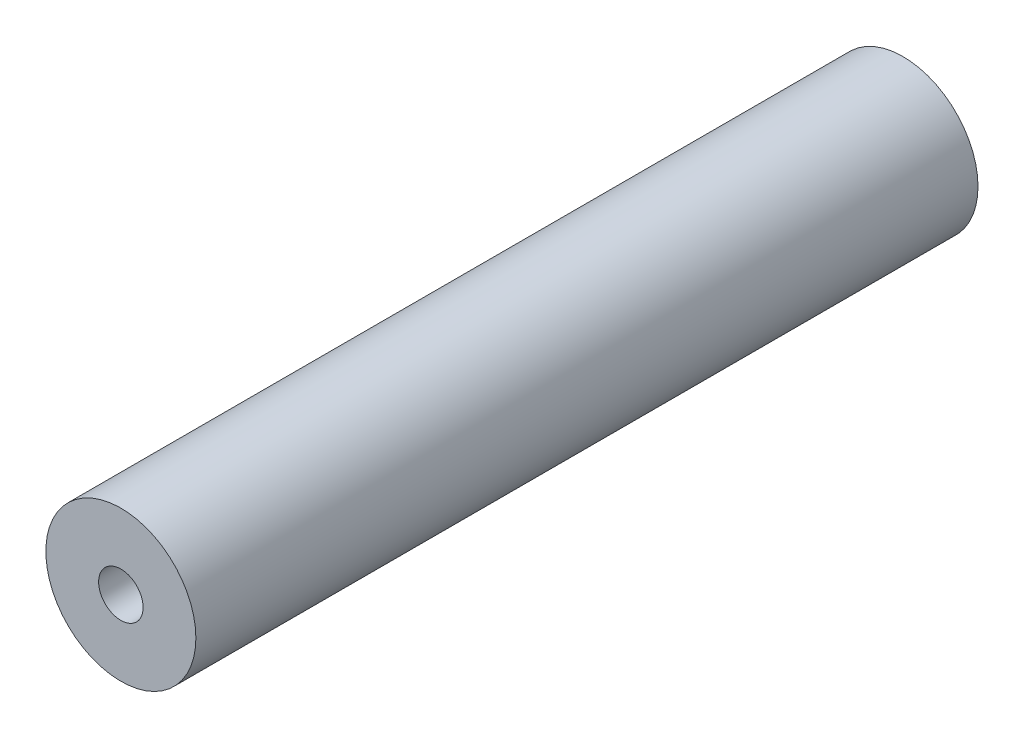
ISO-10303-21;
HEADER;
FILE_DESCRIPTION(('STEP AP214'),'2;1');
FILE_NAME('part.step','',(''),(''),'','','');
FILE_SCHEMA(('AUTOMOTIVE_DESIGN { 1 0 10303 214 1 1 1 1 }'));
ENDSEC;
DATA;
#1=APPLICATION_CONTEXT('core data for automotive mechanical design processes');
#2=APPLICATION_PROTOCOL_DEFINITION('international standard','automotive_design',2000,#1);
#3=PRODUCT_CONTEXT('',#1,'mechanical');
#4=PRODUCT('Part','Part','',(#3));
#5=PRODUCT_RELATED_PRODUCT_CATEGORY('part','',(#4));
#6=PRODUCT_DEFINITION_FORMATION('','',#4);
#7=PRODUCT_DEFINITION_CONTEXT('part definition',#1,'design');
#8=PRODUCT_DEFINITION('design','',#6,#7);
#9=PRODUCT_DEFINITION_SHAPE('','',#8);
#10=(LENGTH_UNIT() NAMED_UNIT(*) SI_UNIT(.MILLI.,.METRE.));
#11=(NAMED_UNIT(*) PLANE_ANGLE_UNIT() SI_UNIT($,.RADIAN.));
#12=(NAMED_UNIT(*) SI_UNIT($,.STERADIAN.) SOLID_ANGLE_UNIT());
#13=UNCERTAINTY_MEASURE_WITH_UNIT(LENGTH_MEASURE(1.E-05),#10,'distance_accuracy_value','');
#14=(GEOMETRIC_REPRESENTATION_CONTEXT(3) GLOBAL_UNCERTAINTY_ASSIGNED_CONTEXT((#13)) GLOBAL_UNIT_ASSIGNED_CONTEXT((#10,
#11,#12)) REPRESENTATION_CONTEXT('',''));
#15=CARTESIAN_POINT('',(0.,0.,0.));
#16=DIRECTION('',(0.,0.,1.));
#17=DIRECTION('',(1.,0.,0.));
#18=AXIS2_PLACEMENT_3D('',#15,#16,#17);
#19=CARTESIAN_POINT('',(0.,0.,66.73));
#20=DIRECTION('',(0.,0.,-1.));
#21=DIRECTION('',(-1.,0.,0.));
#22=AXIS2_PLACEMENT_3D('',#19,#20,#21);
#23=CYLINDRICAL_SURFACE('',#22,6.4);
#24=CARTESIAN_POINT('',(0.,0.,66.73));
#25=DIRECTION('',(0.,0.,1.));
#26=DIRECTION('',(1.,0.,0.));
#27=AXIS2_PLACEMENT_3D('',#24,#25,#26);
#28=CIRCLE('',#27,6.4);
#29=CARTESIAN_POINT('',(6.4,0.,66.73));
#30=VERTEX_POINT('',#29);
#31=EDGE_CURVE('E11',#30,#30,#28,.T.);
#32=ORIENTED_EDGE('',*,*,#31,.F.);
#33=EDGE_LOOP('',(#32));
#34=FACE_BOUND('',#33,.T.);
#35=CARTESIAN_POINT('',(0.,0.,0.));
#36=DIRECTION('',(0.,0.,1.));
#37=DIRECTION('',(1.,0.,0.));
#38=AXIS2_PLACEMENT_3D('',#35,#36,#37);
#39=CIRCLE('',#38,6.4);
#40=CARTESIAN_POINT('',(6.4,0.,0.));
#41=VERTEX_POINT('',#40);
#42=EDGE_CURVE('E35',#41,#41,#39,.T.);
#43=ORIENTED_EDGE('',*,*,#42,.T.);
#44=EDGE_LOOP('',(#43));
#45=FACE_BOUND('',#44,.T.);
#46=ADVANCED_FACE('F32',(#34,#45),#23,.T.);
#47=CARTESIAN_POINT('',(0.,0.,66.73));
#48=DIRECTION('',(0.,0.,1.));
#49=DIRECTION('',(1.,0.,0.));
#50=AXIS2_PLACEMENT_3D('',#47,#48,#49);
#51=PLANE('',#50);
#52=CARTESIAN_POINT('',(0.,0.,66.73));
#53=DIRECTION('',(0.,0.,1.));
#54=DIRECTION('',(1.,0.,0.));
#55=AXIS2_PLACEMENT_3D('',#52,#53,#54);
#56=CIRCLE('',#55,1.89865);
#57=CARTESIAN_POINT('',(1.89865,0.,66.73));
#58=VERTEX_POINT('',#57);
#59=EDGE_CURVE('E56',#58,#58,#56,.T.);
#60=ORIENTED_EDGE('',*,*,#59,.F.);
#61=EDGE_LOOP('',(#60));
#62=FACE_BOUND('',#61,.T.);
#63=ORIENTED_EDGE('',*,*,#31,.T.);
#64=EDGE_LOOP('',(#63));
#65=FACE_BOUND('',#64,.T.);
#66=ADVANCED_FACE('F74',(#62,#65),#51,.T.);
#67=CARTESIAN_POINT('',(0.,0.,0.));
#68=DIRECTION('',(0.,0.,1.));
#69=DIRECTION('',(1.,0.,0.));
#70=AXIS2_PLACEMENT_3D('',#67,#68,#69);
#71=PLANE('',#70);
#72=CARTESIAN_POINT('',(0.,0.,0.));
#73=DIRECTION('',(0.,0.,-1.));
#74=DIRECTION('',(-1.,0.,0.));
#75=AXIS2_PLACEMENT_3D('',#72,#73,#74);
#76=CIRCLE('',#75,1.89865);
#77=CARTESIAN_POINT('',(-1.89865,0.,0.));
#78=VERTEX_POINT('',#77);
#79=EDGE_CURVE('E55',#78,#78,#76,.T.);
#80=ORIENTED_EDGE('',*,*,#79,.F.);
#81=EDGE_LOOP('',(#80));
#82=FACE_BOUND('',#81,.T.);
#83=ORIENTED_EDGE('',*,*,#42,.F.);
#84=EDGE_LOOP('',(#83));
#85=FACE_BOUND('',#84,.T.);
#86=ADVANCED_FACE('F71',(#82,#85),#71,.F.);
#87=CARTESIAN_POINT('',(0.,0.,12.83));
#88=DIRECTION('',(0.,0.,-1.));
#89=DIRECTION('',(-1.,0.,0.));
#90=AXIS2_PLACEMENT_3D('',#87,#88,#89);
#91=CONICAL_SURFACE('',#90,1.89864999999999,1.02974425867665);
#92=CARTESIAN_POINT('',(0.,0.,13.9708240143167));
#93=VERTEX_POINT('',#92);
#94=VERTEX_LOOP('',#93);
#95=FACE_BOUND('',#94,.T.);
#96=CARTESIAN_POINT('',(0.,0.,12.83));
#97=DIRECTION('',(0.,0.,-1.));
#98=DIRECTION('',(-1.,0.,0.));
#99=AXIS2_PLACEMENT_3D('',#96,#97,#98);
#100=CIRCLE('',#99,1.89864999999999);
#101=CARTESIAN_POINT('',(-1.89864999999999,0.,12.83));
#102=VERTEX_POINT('',#101);
#103=EDGE_CURVE('E59',#102,#102,#100,.T.);
#104=ORIENTED_EDGE('',*,*,#103,.T.);
#105=EDGE_LOOP('',(#104));
#106=FACE_BOUND('',#105,.T.);
#107=ADVANCED_FACE('F73',(#95,#106),#91,.F.);
#108=CARTESIAN_POINT('',(0.,0.,0.));
#109=DIRECTION('',(0.,0.,-1.));
#110=DIRECTION('',(-1.,0.,0.));
#111=AXIS2_PLACEMENT_3D('',#108,#109,#110);
#112=CYLINDRICAL_SURFACE('',#111,1.89865);
#113=ORIENTED_EDGE('',*,*,#103,.F.);
#114=EDGE_LOOP('',(#113));
#115=FACE_BOUND('',#114,.T.);
#116=ORIENTED_EDGE('',*,*,#79,.T.);
#117=EDGE_LOOP('',(#116));
#118=FACE_BOUND('',#117,.T.);
#119=ADVANCED_FACE('F49',(#115,#118),#112,.F.);
#120=CARTESIAN_POINT('',(0.,0.,53.9));
#121=DIRECTION('',(0.,0.,1.));
#122=DIRECTION('',(1.,0.,0.));
#123=AXIS2_PLACEMENT_3D('',#120,#121,#122);
#124=CONICAL_SURFACE('',#123,1.89864999999999,1.02974425867665);
#125=CARTESIAN_POINT('',(0.,0.,52.7591759856833));
#126=VERTEX_POINT('',#125);
#127=VERTEX_LOOP('',#126);
#128=FACE_BOUND('',#127,.T.);
#129=CARTESIAN_POINT('',(0.,0.,53.9));
#130=DIRECTION('',(0.,0.,1.));
#131=DIRECTION('',(1.,0.,0.));
#132=AXIS2_PLACEMENT_3D('',#129,#130,#131);
#133=CIRCLE('',#132,1.89864999999999);
#134=CARTESIAN_POINT('',(1.89864999999999,0.,53.9));
#135=VERTEX_POINT('',#134);
#136=EDGE_CURVE('E53',#135,#135,#133,.T.);
#137=ORIENTED_EDGE('',*,*,#136,.T.);
#138=EDGE_LOOP('',(#137));
#139=FACE_BOUND('',#138,.T.);
#140=ADVANCED_FACE('F45',(#128,#139),#124,.F.);
#141=CARTESIAN_POINT('',(0.,0.,66.73));
#142=DIRECTION('',(0.,0.,1.));
#143=DIRECTION('',(1.,0.,0.));
#144=AXIS2_PLACEMENT_3D('',#141,#142,#143);
#145=CYLINDRICAL_SURFACE('',#144,1.89865);
#146=ORIENTED_EDGE('',*,*,#136,.F.);
#147=EDGE_LOOP('',(#146));
#148=FACE_BOUND('',#147,.T.);
#149=ORIENTED_EDGE('',*,*,#59,.T.);
#150=EDGE_LOOP('',(#149));
#151=FACE_BOUND('',#150,.T.);
#152=ADVANCED_FACE('F48',(#148,#151),#145,.F.);
#153=CLOSED_SHELL('',(#46,#66,#86,#107,#119,#140,#152));
#154=MANIFOLD_SOLID_BREP('B2',#153);
#155=ADVANCED_BREP_SHAPE_REPRESENTATION('',(#18,#154),#14);
#156=SHAPE_DEFINITION_REPRESENTATION(#9,#155);
ENDSEC;
END-ISO-10303-21;
